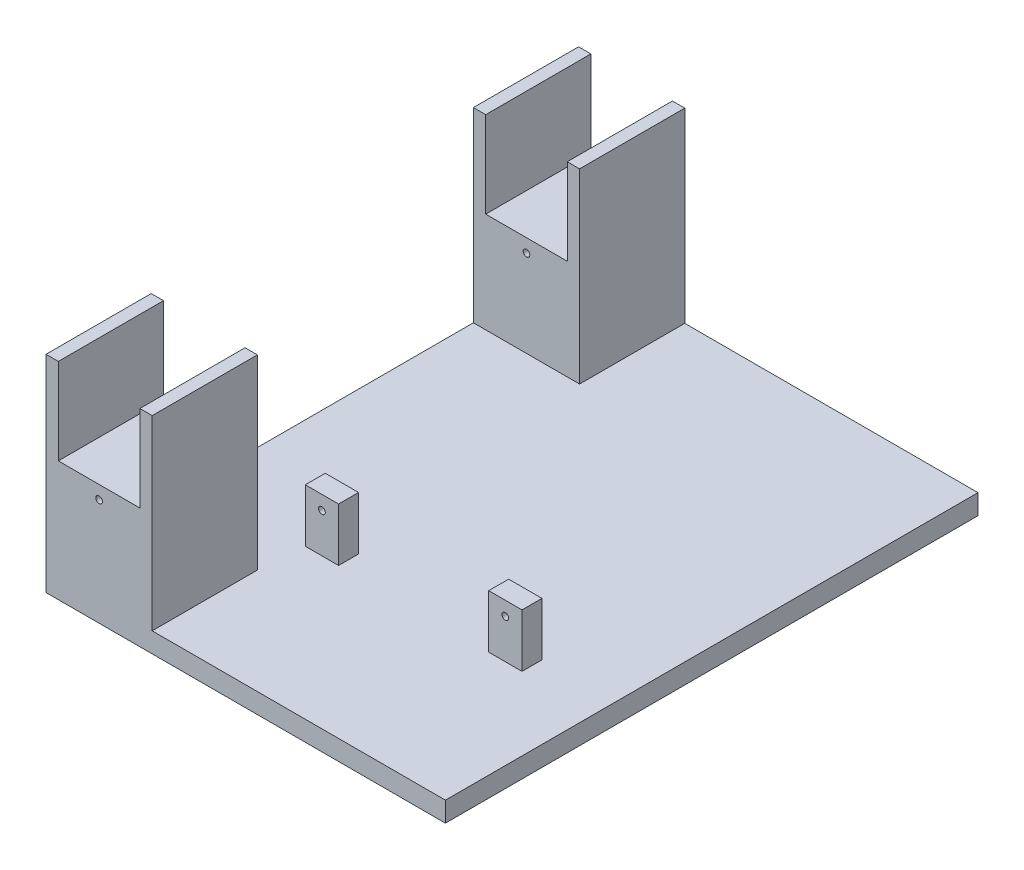
ISO-10303-21;
HEADER;
FILE_DESCRIPTION(('STEP AP214'),'2;1');
FILE_NAME('part.step','',(''),(''),'','','');
FILE_SCHEMA(('AUTOMOTIVE_DESIGN { 1 0 10303 214 1 1 1 1 }'));
ENDSEC;
DATA;
#1=APPLICATION_CONTEXT('core data for automotive mechanical design processes');
#2=APPLICATION_PROTOCOL_DEFINITION('international standard','automotive_design',2000,#1);
#3=PRODUCT_CONTEXT('',#1,'mechanical');
#4=PRODUCT('Part','Part','',(#3));
#5=PRODUCT_RELATED_PRODUCT_CATEGORY('part','',(#4));
#6=PRODUCT_DEFINITION_FORMATION('','',#4);
#7=PRODUCT_DEFINITION_CONTEXT('part definition',#1,'design');
#8=PRODUCT_DEFINITION('design','',#6,#7);
#9=PRODUCT_DEFINITION_SHAPE('','',#8);
#10=(LENGTH_UNIT() NAMED_UNIT(*) SI_UNIT(.MILLI.,.METRE.));
#11=(NAMED_UNIT(*) PLANE_ANGLE_UNIT() SI_UNIT($,.RADIAN.));
#12=(NAMED_UNIT(*) SI_UNIT($,.STERADIAN.) SOLID_ANGLE_UNIT());
#13=UNCERTAINTY_MEASURE_WITH_UNIT(LENGTH_MEASURE(1.E-05),#10,'distance_accuracy_value','');
#14=(GEOMETRIC_REPRESENTATION_CONTEXT(3) GLOBAL_UNCERTAINTY_ASSIGNED_CONTEXT((#13)) GLOBAL_UNIT_ASSIGNED_CONTEXT((#10,
#11,#12)) REPRESENTATION_CONTEXT('',''));
#15=CARTESIAN_POINT('',(0.,0.,0.));
#16=DIRECTION('',(0.,0.,1.));
#17=DIRECTION('',(1.,0.,0.));
#18=AXIS2_PLACEMENT_3D('',#15,#16,#17);
#19=CARTESIAN_POINT('',(0.,3.,0.));
#20=DIRECTION('',(0.,1.,0.));
#21=DIRECTION('',(0.,0.,1.));
#22=AXIS2_PLACEMENT_3D('',#19,#20,#21);
#23=PLANE('',#22);
#24=DIRECTION('',(1.,0.,0.));
#25=VECTOR('',#24,1.);
#26=CARTESIAN_POINT('',(0.,3.,17.5));
#27=LINE('',#26,#25);
#28=CARTESIAN_POINT('',(-13.55,3.,17.5));
#29=VERTEX_POINT('',#28);
#30=CARTESIAN_POINT('',(-8.54999999999999,3.,17.5));
#31=VERTEX_POINT('',#30);
#32=EDGE_CURVE('E290',#29,#31,#27,.T.);
#33=ORIENTED_EDGE('',*,*,#32,.F.);
#34=DIRECTION('',(0.,0.,-1.));
#35=VECTOR('',#34,1.);
#36=CARTESIAN_POINT('',(-13.55,3.,17.5));
#37=LINE('',#36,#35);
#38=CARTESIAN_POINT('',(-13.55,3.,14.5));
#39=VERTEX_POINT('',#38);
#40=EDGE_CURVE('E325',#29,#39,#37,.T.);
#41=ORIENTED_EDGE('',*,*,#40,.T.);
#42=DIRECTION('',(1.,0.,0.));
#43=VECTOR('',#42,1.);
#44=CARTESIAN_POINT('',(0.,3.,14.5));
#45=LINE('',#44,#43);
#46=CARTESIAN_POINT('',(-8.54999999999999,3.,14.5));
#47=VERTEX_POINT('',#46);
#48=EDGE_CURVE('E319',#39,#47,#45,.T.);
#49=ORIENTED_EDGE('',*,*,#48,.T.);
#50=DIRECTION('',(0.,0.,-1.));
#51=VECTOR('',#50,1.);
#52=CARTESIAN_POINT('',(-8.54999999999999,3.,17.5));
#53=LINE('',#52,#51);
#54=EDGE_CURVE('E305',#31,#47,#53,.T.);
#55=ORIENTED_EDGE('',*,*,#54,.F.);
#56=EDGE_LOOP('',(#33,#41,#49,#55));
#57=FACE_BOUND('',#56,.T.);
#58=DIRECTION('',(-1.,0.,0.));
#59=VECTOR('',#58,1.);
#60=CARTESIAN_POINT('',(0.,3.,17.5));
#61=LINE('',#60,#59);
#62=CARTESIAN_POINT('',(19.,3.,17.5));
#63=VERTEX_POINT('',#62);
#64=CARTESIAN_POINT('',(14.,3.,17.5));
#65=VERTEX_POINT('',#64);
#66=EDGE_CURVE('E342',#63,#65,#61,.T.);
#67=ORIENTED_EDGE('',*,*,#66,.T.);
#68=DIRECTION('',(0.,0.,-1.));
#69=VECTOR('',#68,1.);
#70=CARTESIAN_POINT('',(14.,3.,17.5));
#71=LINE('',#70,#69);
#72=CARTESIAN_POINT('',(14.,3.,14.5));
#73=VERTEX_POINT('',#72);
#74=EDGE_CURVE('E371',#65,#73,#71,.T.);
#75=ORIENTED_EDGE('',*,*,#74,.T.);
#76=DIRECTION('',(-1.,0.,0.));
#77=VECTOR('',#76,1.);
#78=CARTESIAN_POINT('',(0.,3.,14.5));
#79=LINE('',#78,#77);
#80=CARTESIAN_POINT('',(19.,3.,14.5));
#81=VERTEX_POINT('',#80);
#82=EDGE_CURVE('E361',#81,#73,#79,.T.);
#83=ORIENTED_EDGE('',*,*,#82,.F.);
#84=DIRECTION('',(0.,0.,-1.));
#85=VECTOR('',#84,1.);
#86=CARTESIAN_POINT('',(19.,3.,17.5));
#87=LINE('',#86,#85);
#88=EDGE_CURVE('E368',#63,#81,#87,.T.);
#89=ORIENTED_EDGE('',*,*,#88,.F.);
#90=EDGE_LOOP('',(#67,#75,#83,#89));
#91=FACE_BOUND('',#90,.T.);
#92=DIRECTION('',(1.,0.,0.));
#93=VECTOR('',#92,1.);
#94=CARTESIAN_POINT('',(-30.,3.,-24.2));
#95=LINE('',#94,#93);
#96=CARTESIAN_POINT('',(-30.,3.,-24.2));
#97=VERTEX_POINT('',#96);
#98=CARTESIAN_POINT('',(-14.05,3.,-24.2));
#99=VERTEX_POINT('',#98);
#100=EDGE_CURVE('E411',#97,#99,#95,.T.);
#101=ORIENTED_EDGE('',*,*,#100,.F.);
#102=DIRECTION('',(0.,0.,1.));
#103=VECTOR('',#102,1.);
#104=CARTESIAN_POINT('',(-30.,3.,-40.));
#105=LINE('',#104,#103);
#106=CARTESIAN_POINT('',(-30.,3.,24.2));
#107=VERTEX_POINT('',#106);
#108=EDGE_CURVE('E547',#97,#107,#105,.T.);
#109=ORIENTED_EDGE('',*,*,#108,.T.);
#110=DIRECTION('',(1.,0.,0.));
#111=VECTOR('',#110,1.);
#112=CARTESIAN_POINT('',(-30.,3.,24.2));
#113=LINE('',#112,#111);
#114=CARTESIAN_POINT('',(-14.05,3.,24.2));
#115=VERTEX_POINT('',#114);
#116=EDGE_CURVE('E494',#107,#115,#113,.T.);
#117=ORIENTED_EDGE('',*,*,#116,.T.);
#118=DIRECTION('',(0.,0.,1.));
#119=VECTOR('',#118,1.);
#120=CARTESIAN_POINT('',(-14.05,3.,24.2));
#121=LINE('',#120,#119);
#122=CARTESIAN_POINT('',(-14.05,3.,40.));
#123=VERTEX_POINT('',#122);
#124=EDGE_CURVE('E525',#115,#123,#121,.T.);
#125=ORIENTED_EDGE('',*,*,#124,.T.);
#126=DIRECTION('',(1.,0.,0.));
#127=VECTOR('',#126,1.);
#128=CARTESIAN_POINT('',(-30.,3.,40.));
#129=LINE('',#128,#127);
#130=CARTESIAN_POINT('',(30.,3.,40.));
#131=VERTEX_POINT('',#130);
#132=EDGE_CURVE('E550',#123,#131,#129,.T.);
#133=ORIENTED_EDGE('',*,*,#132,.T.);
#134=DIRECTION('',(0.,0.,-1.));
#135=VECTOR('',#134,1.);
#136=CARTESIAN_POINT('',(30.,3.,-40.));
#137=LINE('',#136,#135);
#138=CARTESIAN_POINT('',(30.,3.,-40.));
#139=VERTEX_POINT('',#138);
#140=EDGE_CURVE('E554',#131,#139,#137,.T.);
#141=ORIENTED_EDGE('',*,*,#140,.T.);
#142=DIRECTION('',(-1.,0.,0.));
#143=VECTOR('',#142,1.);
#144=CARTESIAN_POINT('',(-30.,3.,-40.));
#145=LINE('',#144,#143);
#146=CARTESIAN_POINT('',(-14.05,3.,-40.));
#147=VERTEX_POINT('',#146);
#148=EDGE_CURVE('E557',#139,#147,#145,.T.);
#149=ORIENTED_EDGE('',*,*,#148,.T.);
#150=DIRECTION('',(0.,0.,-1.));
#151=VECTOR('',#150,1.);
#152=CARTESIAN_POINT('',(-14.05,3.,-24.2));
#153=LINE('',#152,#151);
#154=EDGE_CURVE('E447',#99,#147,#153,.T.);
#155=ORIENTED_EDGE('',*,*,#154,.F.);
#156=EDGE_LOOP('',(#101,#109,#117,#125,#133,#141,#149,#155));
#157=FACE_BOUND('',#156,.T.);
#158=ADVANCED_FACE('F97',(#57,#91,#157),#23,.T.);
#159=CARTESIAN_POINT('',(-30.,3.,-40.));
#160=DIRECTION('',(1.,0.,0.));
#161=DIRECTION('',(0.,0.,-1.));
#162=AXIS2_PLACEMENT_3D('',#159,#160,#161);
#163=PLANE('',#162);
#164=DIRECTION('',(0.,0.,1.));
#165=VECTOR('',#164,1.);
#166=CARTESIAN_POINT('',(-30.,0.,-40.));
#167=LINE('',#166,#165);
#168=CARTESIAN_POINT('',(-30.,0.,-40.));
#169=VERTEX_POINT('',#168);
#170=CARTESIAN_POINT('',(-30.,0.,40.));
#171=VERTEX_POINT('',#170);
#172=EDGE_CURVE('E546',#169,#171,#167,.T.);
#173=ORIENTED_EDGE('',*,*,#172,.T.);
#174=DIRECTION('',(0.,-1.,0.));
#175=VECTOR('',#174,1.);
#176=CARTESIAN_POINT('',(-30.,3.,40.));
#177=LINE('',#176,#175);
#178=CARTESIAN_POINT('',(-30.,31.,40.));
#179=VERTEX_POINT('',#178);
#180=EDGE_CURVE('E12',#179,#171,#177,.T.);
#181=ORIENTED_EDGE('',*,*,#180,.F.);
#182=DIRECTION('',(0.,0.,1.));
#183=VECTOR('',#182,1.);
#184=CARTESIAN_POINT('',(-30.,31.,24.2));
#185=LINE('',#184,#183);
#186=CARTESIAN_POINT('',(-30.,31.,24.2));
#187=VERTEX_POINT('',#186);
#188=EDGE_CURVE('E501',#187,#179,#185,.T.);
#189=ORIENTED_EDGE('',*,*,#188,.F.);
#190=DIRECTION('',(0.,1.,0.));
#191=VECTOR('',#190,1.);
#192=CARTESIAN_POINT('',(-30.,3.,24.2));
#193=LINE('',#192,#191);
#194=EDGE_CURVE('E498',#107,#187,#193,.T.);
#195=ORIENTED_EDGE('',*,*,#194,.F.);
#196=ORIENTED_EDGE('',*,*,#108,.F.);
#197=DIRECTION('',(0.,1.,0.));
#198=VECTOR('',#197,1.);
#199=CARTESIAN_POINT('',(-30.,3.,-24.2));
#200=LINE('',#199,#198);
#201=CARTESIAN_POINT('',(-30.,31.,-24.2));
#202=VERTEX_POINT('',#201);
#203=EDGE_CURVE('E415',#97,#202,#200,.T.);
#204=ORIENTED_EDGE('',*,*,#203,.T.);
#205=DIRECTION('',(0.,0.,-1.));
#206=VECTOR('',#205,1.);
#207=CARTESIAN_POINT('',(-30.,31.,-24.2));
#208=LINE('',#207,#206);
#209=CARTESIAN_POINT('',(-30.,31.,-40.));
#210=VERTEX_POINT('',#209);
#211=EDGE_CURVE('E442',#202,#210,#208,.T.);
#212=ORIENTED_EDGE('',*,*,#211,.T.);
#213=DIRECTION('',(0.,-1.,0.));
#214=VECTOR('',#213,1.);
#215=CARTESIAN_POINT('',(-30.,3.,-40.));
#216=LINE('',#215,#214);
#217=EDGE_CURVE('E560',#210,#169,#216,.T.);
#218=ORIENTED_EDGE('',*,*,#217,.T.);
#219=EDGE_LOOP('',(#173,#181,#189,#195,#196,#204,#212,#218));
#220=FACE_BOUND('',#219,.T.);
#221=ADVANCED_FACE('F99',(#220),#163,.F.);
#222=CARTESIAN_POINT('',(-30.,3.,40.));
#223=DIRECTION('',(0.,0.,-1.));
#224=DIRECTION('',(-1.,0.,0.));
#225=AXIS2_PLACEMENT_3D('',#222,#223,#224);
#226=PLANE('',#225);
#227=DIRECTION('',(1.,0.,0.));
#228=VECTOR('',#227,1.);
#229=CARTESIAN_POINT('',(-30.,0.,40.));
#230=LINE('',#229,#228);
#231=CARTESIAN_POINT('',(30.,0.,40.));
#232=VERTEX_POINT('',#231);
#233=EDGE_CURVE('E564',#171,#232,#230,.T.);
#234=ORIENTED_EDGE('',*,*,#233,.T.);
#235=DIRECTION('',(0.,-1.,0.));
#236=VECTOR('',#235,1.);
#237=CARTESIAN_POINT('',(30.,3.,40.));
#238=LINE('',#237,#236);
#239=EDGE_CURVE('E106',#131,#232,#238,.T.);
#240=ORIENTED_EDGE('',*,*,#239,.F.);
#241=ORIENTED_EDGE('',*,*,#132,.F.);
#242=DIRECTION('',(0.,1.,0.));
#243=VECTOR('',#242,1.);
#244=CARTESIAN_POINT('',(-14.05,3.,40.));
#245=LINE('',#244,#243);
#246=CARTESIAN_POINT('',(-14.05,31.,40.));
#247=VERTEX_POINT('',#246);
#248=EDGE_CURVE('E477',#123,#247,#245,.T.);
#249=ORIENTED_EDGE('',*,*,#248,.T.);
#250=DIRECTION('',(1.,0.,0.));
#251=VECTOR('',#250,1.);
#252=CARTESIAN_POINT('',(-30.,31.,40.));
#253=LINE('',#252,#251);
#254=CARTESIAN_POINT('',(-15.9,31.,40.));
#255=VERTEX_POINT('',#254);
#256=EDGE_CURVE('E515',#255,#247,#253,.T.);
#257=ORIENTED_EDGE('',*,*,#256,.F.);
#258=DIRECTION('',(0.,1.,0.));
#259=VECTOR('',#258,1.);
#260=CARTESIAN_POINT('',(-15.9,3.,40.));
#261=LINE('',#260,#259);
#262=CARTESIAN_POINT('',(-15.9,18.0561761961018,40.));
#263=VERTEX_POINT('',#262);
#264=EDGE_CURVE('E512',#263,#255,#261,.T.);
#265=ORIENTED_EDGE('',*,*,#264,.F.);
#266=DIRECTION('',(1.,0.,0.));
#267=VECTOR('',#266,1.);
#268=CARTESIAN_POINT('',(-30.,18.0561761961018,40.));
#269=LINE('',#268,#267);
#270=CARTESIAN_POINT('',(-28.15,18.0561761961018,40.));
#271=VERTEX_POINT('',#270);
#272=EDGE_CURVE('E509',#271,#263,#269,.T.);
#273=ORIENTED_EDGE('',*,*,#272,.F.);
#274=DIRECTION('',(0.,1.,0.));
#275=VECTOR('',#274,1.);
#276=CARTESIAN_POINT('',(-28.15,3.,40.));
#277=LINE('',#276,#275);
#278=CARTESIAN_POINT('',(-28.15,31.,40.));
#279=VERTEX_POINT('',#278);
#280=EDGE_CURVE('E505',#271,#279,#277,.T.);
#281=ORIENTED_EDGE('',*,*,#280,.T.);
#282=DIRECTION('',(1.,0.,0.));
#283=VECTOR('',#282,1.);
#284=CARTESIAN_POINT('',(-30.,31.,40.));
#285=LINE('',#284,#283);
#286=EDGE_CURVE('E469',#179,#279,#285,.T.);
#287=ORIENTED_EDGE('',*,*,#286,.F.);
#288=ORIENTED_EDGE('',*,*,#180,.T.);
#289=EDGE_LOOP('',(#234,#240,#241,#249,#257,#265,#273,#281,#287,#288));
#290=FACE_BOUND('',#289,.T.);
#291=CARTESIAN_POINT('',(-22.025,16.0561761961018,40.));
#292=DIRECTION('',(0.,0.,-1.));
#293=DIRECTION('',(-1.,0.,0.));
#294=AXIS2_PLACEMENT_3D('',#291,#292,#293);
#295=CIRCLE('',#294,0.499999999999999);
#296=CARTESIAN_POINT('',(-22.525,16.0561761961018,40.));
#297=VERTEX_POINT('',#296);
#298=EDGE_CURVE('E446',#297,#297,#295,.T.);
#299=ORIENTED_EDGE('',*,*,#298,.T.);
#300=EDGE_LOOP('',(#299));
#301=FACE_BOUND('',#300,.T.);
#302=ADVANCED_FACE('F647',(#290,#301),#226,.F.);
#303=CARTESIAN_POINT('',(30.,3.,-40.));
#304=DIRECTION('',(-1.,0.,0.));
#305=DIRECTION('',(0.,0.,1.));
#306=AXIS2_PLACEMENT_3D('',#303,#304,#305);
#307=PLANE('',#306);
#308=DIRECTION('',(0.,0.,-1.));
#309=VECTOR('',#308,1.);
#310=CARTESIAN_POINT('',(30.,0.,-40.));
#311=LINE('',#310,#309);
#312=CARTESIAN_POINT('',(30.,0.,-40.));
#313=VERTEX_POINT('',#312);
#314=EDGE_CURVE('E567',#232,#313,#311,.T.);
#315=ORIENTED_EDGE('',*,*,#314,.T.);
#316=DIRECTION('',(0.,-1.,0.));
#317=VECTOR('',#316,1.);
#318=CARTESIAN_POINT('',(30.,3.,-40.));
#319=LINE('',#318,#317);
#320=EDGE_CURVE('E575',#139,#313,#319,.T.);
#321=ORIENTED_EDGE('',*,*,#320,.F.);
#322=ORIENTED_EDGE('',*,*,#140,.F.);
#323=ORIENTED_EDGE('',*,*,#239,.T.);
#324=EDGE_LOOP('',(#315,#321,#322,#323));
#325=FACE_BOUND('',#324,.T.);
#326=ADVANCED_FACE('F584',(#325),#307,.F.);
#327=CARTESIAN_POINT('',(-30.,3.,-40.));
#328=DIRECTION('',(0.,0.,1.));
#329=DIRECTION('',(1.,0.,0.));
#330=AXIS2_PLACEMENT_3D('',#327,#328,#329);
#331=PLANE('',#330);
#332=DIRECTION('',(-1.,0.,0.));
#333=VECTOR('',#332,1.);
#334=CARTESIAN_POINT('',(-30.,0.,-40.));
#335=LINE('',#334,#333);
#336=EDGE_CURVE('E551',#313,#169,#335,.T.);
#337=ORIENTED_EDGE('',*,*,#336,.T.);
#338=ORIENTED_EDGE('',*,*,#217,.F.);
#339=DIRECTION('',(1.,0.,0.));
#340=VECTOR('',#339,1.);
#341=CARTESIAN_POINT('',(-30.,31.,-40.));
#342=LINE('',#341,#340);
#343=CARTESIAN_POINT('',(-28.15,31.,-40.));
#344=VERTEX_POINT('',#343);
#345=EDGE_CURVE('E384',#210,#344,#342,.T.);
#346=ORIENTED_EDGE('',*,*,#345,.T.);
#347=DIRECTION('',(0.,1.,0.));
#348=VECTOR('',#347,1.);
#349=CARTESIAN_POINT('',(-28.15,3.,-40.));
#350=LINE('',#349,#348);
#351=CARTESIAN_POINT('',(-28.15,18.0561761961018,-40.));
#352=VERTEX_POINT('',#351);
#353=EDGE_CURVE('E423',#352,#344,#350,.T.);
#354=ORIENTED_EDGE('',*,*,#353,.F.);
#355=DIRECTION('',(1.,0.,0.));
#356=VECTOR('',#355,1.);
#357=CARTESIAN_POINT('',(-30.,18.0561761961018,-40.));
#358=LINE('',#357,#356);
#359=CARTESIAN_POINT('',(-15.9,18.0561761961018,-40.));
#360=VERTEX_POINT('',#359);
#361=EDGE_CURVE('E427',#352,#360,#358,.T.);
#362=ORIENTED_EDGE('',*,*,#361,.T.);
#363=DIRECTION('',(0.,1.,0.));
#364=VECTOR('',#363,1.);
#365=CARTESIAN_POINT('',(-15.9,3.,-40.));
#366=LINE('',#365,#364);
#367=CARTESIAN_POINT('',(-15.9,31.,-40.));
#368=VERTEX_POINT('',#367);
#369=EDGE_CURVE('E431',#360,#368,#366,.T.);
#370=ORIENTED_EDGE('',*,*,#369,.T.);
#371=DIRECTION('',(1.,0.,0.));
#372=VECTOR('',#371,1.);
#373=CARTESIAN_POINT('',(-30.,31.,-40.));
#374=LINE('',#373,#372);
#375=CARTESIAN_POINT('',(-14.05,31.,-40.));
#376=VERTEX_POINT('',#375);
#377=EDGE_CURVE('E435',#368,#376,#374,.T.);
#378=ORIENTED_EDGE('',*,*,#377,.T.);
#379=DIRECTION('',(0.,1.,0.));
#380=VECTOR('',#379,1.);
#381=CARTESIAN_POINT('',(-14.05,3.,-40.));
#382=LINE('',#381,#380);
#383=EDGE_CURVE('E393',#147,#376,#382,.T.);
#384=ORIENTED_EDGE('',*,*,#383,.F.);
#385=ORIENTED_EDGE('',*,*,#148,.F.);
#386=ORIENTED_EDGE('',*,*,#320,.T.);
#387=EDGE_LOOP('',(#337,#338,#346,#354,#362,#370,#378,#384,#385,#386));
#388=FACE_BOUND('',#387,.T.);
#389=CARTESIAN_POINT('',(-22.025,16.0561761961018,-40.));
#390=DIRECTION('',(0.,0.,1.));
#391=DIRECTION('',(1.,0.,0.));
#392=AXIS2_PLACEMENT_3D('',#389,#390,#391);
#393=CIRCLE('',#392,0.499999999999999);
#394=CARTESIAN_POINT('',(-21.525,16.0561761961018,-40.));
#395=VERTEX_POINT('',#394);
#396=EDGE_CURVE('E379',#395,#395,#393,.T.);
#397=ORIENTED_EDGE('',*,*,#396,.T.);
#398=EDGE_LOOP('',(#397));
#399=FACE_BOUND('',#398,.T.);
#400=ADVANCED_FACE('F593',(#388,#399),#331,.F.);
#401=CARTESIAN_POINT('',(0.,0.,0.));
#402=DIRECTION('',(0.,1.,0.));
#403=DIRECTION('',(0.,0.,1.));
#404=AXIS2_PLACEMENT_3D('',#401,#402,#403);
#405=PLANE('',#404);
#406=ORIENTED_EDGE('',*,*,#172,.F.);
#407=ORIENTED_EDGE('',*,*,#336,.F.);
#408=ORIENTED_EDGE('',*,*,#314,.F.);
#409=ORIENTED_EDGE('',*,*,#233,.F.);
#410=EDGE_LOOP('',(#406,#407,#408,#409));
#411=FACE_BOUND('',#410,.T.);
#412=ADVANCED_FACE('F591',(#411),#405,.F.);
#413=CARTESIAN_POINT('',(0.,0.,24.2));
#414=DIRECTION('',(0.,0.,1.));
#415=DIRECTION('',(1.,0.,0.));
#416=AXIS2_PLACEMENT_3D('',#413,#414,#415);
#417=PLANE('',#416);
#418=DIRECTION('',(1.,0.,0.));
#419=VECTOR('',#418,1.);
#420=CARTESIAN_POINT('',(-30.,31.,24.2));
#421=LINE('',#420,#419);
#422=CARTESIAN_POINT('',(-28.15,31.,24.2));
#423=VERTEX_POINT('',#422);
#424=EDGE_CURVE('E473',#187,#423,#421,.T.);
#425=ORIENTED_EDGE('',*,*,#424,.T.);
#426=DIRECTION('',(0.,1.,0.));
#427=VECTOR('',#426,1.);
#428=CARTESIAN_POINT('',(-28.15,3.,24.2));
#429=LINE('',#428,#427);
#430=CARTESIAN_POINT('',(-28.15,18.0561761961018,24.2));
#431=VERTEX_POINT('',#430);
#432=EDGE_CURVE('E476',#431,#423,#429,.T.);
#433=ORIENTED_EDGE('',*,*,#432,.F.);
#434=DIRECTION('',(1.,0.,0.));
#435=VECTOR('',#434,1.);
#436=CARTESIAN_POINT('',(-30.,18.0561761961018,24.2));
#437=LINE('',#436,#435);
#438=CARTESIAN_POINT('',(-15.9,18.0561761961018,24.2));
#439=VERTEX_POINT('',#438);
#440=EDGE_CURVE('E481',#431,#439,#437,.T.);
#441=ORIENTED_EDGE('',*,*,#440,.T.);
#442=DIRECTION('',(0.,1.,0.));
#443=VECTOR('',#442,1.);
#444=CARTESIAN_POINT('',(-15.9,3.,24.2));
#445=LINE('',#444,#443);
#446=CARTESIAN_POINT('',(-15.9,31.,24.2));
#447=VERTEX_POINT('',#446);
#448=EDGE_CURVE('E484',#439,#447,#445,.T.);
#449=ORIENTED_EDGE('',*,*,#448,.T.);
#450=DIRECTION('',(1.,0.,0.));
#451=VECTOR('',#450,1.);
#452=CARTESIAN_POINT('',(-30.,31.,24.2));
#453=LINE('',#452,#451);
#454=CARTESIAN_POINT('',(-14.05,31.,24.2));
#455=VERTEX_POINT('',#454);
#456=EDGE_CURVE('E487',#447,#455,#453,.T.);
#457=ORIENTED_EDGE('',*,*,#456,.T.);
#458=DIRECTION('',(0.,1.,0.));
#459=VECTOR('',#458,1.);
#460=CARTESIAN_POINT('',(-14.05,3.,24.2));
#461=LINE('',#460,#459);
#462=EDGE_CURVE('E490',#115,#455,#461,.T.);
#463=ORIENTED_EDGE('',*,*,#462,.F.);
#464=ORIENTED_EDGE('',*,*,#116,.F.);
#465=ORIENTED_EDGE('',*,*,#194,.T.);
#466=EDGE_LOOP('',(#425,#433,#441,#449,#457,#463,#464,#465));
#467=FACE_BOUND('',#466,.T.);
#468=CARTESIAN_POINT('',(-22.025,16.0561761961018,24.2));
#469=DIRECTION('',(0.,0.,-1.));
#470=DIRECTION('',(-1.,0.,0.));
#471=AXIS2_PLACEMENT_3D('',#468,#469,#470);
#472=CIRCLE('',#471,0.499999999999999);
#473=CARTESIAN_POINT('',(-22.525,16.0561761961018,24.2));
#474=VERTEX_POINT('',#473);
#475=EDGE_CURVE('E465',#474,#474,#472,.T.);
#476=ORIENTED_EDGE('',*,*,#475,.F.);
#477=EDGE_LOOP('',(#476));
#478=FACE_BOUND('',#477,.T.);
#479=ADVANCED_FACE('F655',(#467,#478),#417,.F.);
#480=CARTESIAN_POINT('',(-30.,31.,24.2));
#481=DIRECTION('',(0.,-1.,0.));
#482=DIRECTION('',(0.,0.,-1.));
#483=AXIS2_PLACEMENT_3D('',#480,#481,#482);
#484=PLANE('',#483);
#485=ORIENTED_EDGE('',*,*,#286,.T.);
#486=DIRECTION('',(0.,0.,1.));
#487=VECTOR('',#486,1.);
#488=CARTESIAN_POINT('',(-28.15,31.,24.2));
#489=LINE('',#488,#487);
#490=EDGE_CURVE('E543',#423,#279,#489,.T.);
#491=ORIENTED_EDGE('',*,*,#490,.F.);
#492=ORIENTED_EDGE('',*,*,#424,.F.);
#493=ORIENTED_EDGE('',*,*,#188,.T.);
#494=EDGE_LOOP('',(#485,#491,#492,#493));
#495=FACE_BOUND('',#494,.T.);
#496=ADVANCED_FACE('F651',(#495),#484,.F.);
#497=CARTESIAN_POINT('',(-28.15,3.,24.2));
#498=DIRECTION('',(1.,0.,0.));
#499=DIRECTION('',(0.,0.,-1.));
#500=AXIS2_PLACEMENT_3D('',#497,#498,#499);
#501=PLANE('',#500);
#502=ORIENTED_EDGE('',*,*,#280,.F.);
#503=DIRECTION('',(0.,0.,1.));
#504=VECTOR('',#503,1.);
#505=CARTESIAN_POINT('',(-28.15,18.0561761961018,24.2));
#506=LINE('',#505,#504);
#507=EDGE_CURVE('E540',#431,#271,#506,.T.);
#508=ORIENTED_EDGE('',*,*,#507,.F.);
#509=ORIENTED_EDGE('',*,*,#432,.T.);
#510=ORIENTED_EDGE('',*,*,#490,.T.);
#511=EDGE_LOOP('',(#502,#508,#509,#510));
#512=FACE_BOUND('',#511,.T.);
#513=ADVANCED_FACE('F691',(#512),#501,.T.);
#514=CARTESIAN_POINT('',(-30.,18.0561761961018,24.2));
#515=DIRECTION('',(0.,-1.,0.));
#516=DIRECTION('',(0.,0.,-1.));
#517=AXIS2_PLACEMENT_3D('',#514,#515,#516);
#518=PLANE('',#517);
#519=ORIENTED_EDGE('',*,*,#272,.T.);
#520=DIRECTION('',(0.,0.,1.));
#521=VECTOR('',#520,1.);
#522=CARTESIAN_POINT('',(-15.9,18.0561761961018,24.2));
#523=LINE('',#522,#521);
#524=EDGE_CURVE('E536',#439,#263,#523,.T.);
#525=ORIENTED_EDGE('',*,*,#524,.F.);
#526=ORIENTED_EDGE('',*,*,#440,.F.);
#527=ORIENTED_EDGE('',*,*,#507,.T.);
#528=EDGE_LOOP('',(#519,#525,#526,#527));
#529=FACE_BOUND('',#528,.T.);
#530=ADVANCED_FACE('F688',(#529),#518,.F.);
#531=CARTESIAN_POINT('',(-15.9,3.,24.2));
#532=DIRECTION('',(1.,0.,0.));
#533=DIRECTION('',(0.,0.,-1.));
#534=AXIS2_PLACEMENT_3D('',#531,#532,#533);
#535=PLANE('',#534);
#536=ORIENTED_EDGE('',*,*,#264,.T.);
#537=DIRECTION('',(0.,0.,1.));
#538=VECTOR('',#537,1.);
#539=CARTESIAN_POINT('',(-15.9,31.,24.2));
#540=LINE('',#539,#538);
#541=EDGE_CURVE('E532',#447,#255,#540,.T.);
#542=ORIENTED_EDGE('',*,*,#541,.F.);
#543=ORIENTED_EDGE('',*,*,#448,.F.);
#544=ORIENTED_EDGE('',*,*,#524,.T.);
#545=EDGE_LOOP('',(#536,#542,#543,#544));
#546=FACE_BOUND('',#545,.T.);
#547=ADVANCED_FACE('F684',(#546),#535,.F.);
#548=CARTESIAN_POINT('',(-30.,31.,24.2));
#549=DIRECTION('',(0.,-1.,0.));
#550=DIRECTION('',(0.,0.,-1.));
#551=AXIS2_PLACEMENT_3D('',#548,#549,#550);
#552=PLANE('',#551);
#553=ORIENTED_EDGE('',*,*,#256,.T.);
#554=DIRECTION('',(0.,0.,1.));
#555=VECTOR('',#554,1.);
#556=CARTESIAN_POINT('',(-14.05,31.,24.2));
#557=LINE('',#556,#555);
#558=EDGE_CURVE('E529',#455,#247,#557,.T.);
#559=ORIENTED_EDGE('',*,*,#558,.F.);
#560=ORIENTED_EDGE('',*,*,#456,.F.);
#561=ORIENTED_EDGE('',*,*,#541,.T.);
#562=EDGE_LOOP('',(#553,#559,#560,#561));
#563=FACE_BOUND('',#562,.T.);
#564=ADVANCED_FACE('F675',(#563),#552,.F.);
#565=CARTESIAN_POINT('',(-14.05,3.,24.2));
#566=DIRECTION('',(1.,0.,0.));
#567=DIRECTION('',(0.,1.,0.));
#568=AXIS2_PLACEMENT_3D('',#565,#566,#567);
#569=PLANE('',#568);
#570=ORIENTED_EDGE('',*,*,#248,.F.);
#571=ORIENTED_EDGE('',*,*,#124,.F.);
#572=ORIENTED_EDGE('',*,*,#462,.T.);
#573=ORIENTED_EDGE('',*,*,#558,.T.);
#574=EDGE_LOOP('',(#570,#571,#572,#573));
#575=FACE_BOUND('',#574,.T.);
#576=ADVANCED_FACE('F667',(#575),#569,.T.);
#577=CARTESIAN_POINT('',(-22.025,16.0561761961018,24.2));
#578=DIRECTION('',(0.,0.,1.));
#579=DIRECTION('',(1.,0.,0.));
#580=AXIS2_PLACEMENT_3D('',#577,#578,#579);
#581=CYLINDRICAL_SURFACE('',#580,0.499999999999999);
#582=ORIENTED_EDGE('',*,*,#475,.T.);
#583=EDGE_LOOP('',(#582));
#584=FACE_BOUND('',#583,.T.);
#585=ORIENTED_EDGE('',*,*,#298,.F.);
#586=EDGE_LOOP('',(#585));
#587=FACE_BOUND('',#586,.T.);
#588=ADVANCED_FACE('F665',(#584,#587),#581,.F.);
#589=CARTESIAN_POINT('',(0.,0.,-24.2));
#590=DIRECTION('',(0.,0.,1.));
#591=DIRECTION('',(1.,0.,0.));
#592=AXIS2_PLACEMENT_3D('',#589,#590,#591);
#593=PLANE('',#592);
#594=DIRECTION('',(1.,0.,0.));
#595=VECTOR('',#594,1.);
#596=CARTESIAN_POINT('',(-30.,31.,-24.2));
#597=LINE('',#596,#595);
#598=CARTESIAN_POINT('',(-28.15,31.,-24.2));
#599=VERTEX_POINT('',#598);
#600=EDGE_CURVE('E388',#202,#599,#597,.T.);
#601=ORIENTED_EDGE('',*,*,#600,.F.);
#602=ORIENTED_EDGE('',*,*,#203,.F.);
#603=ORIENTED_EDGE('',*,*,#100,.T.);
#604=DIRECTION('',(0.,1.,0.));
#605=VECTOR('',#604,1.);
#606=CARTESIAN_POINT('',(-14.05,3.,-24.2));
#607=LINE('',#606,#605);
#608=CARTESIAN_POINT('',(-14.05,31.,-24.2));
#609=VERTEX_POINT('',#608);
#610=EDGE_CURVE('E408',#99,#609,#607,.T.);
#611=ORIENTED_EDGE('',*,*,#610,.T.);
#612=DIRECTION('',(1.,0.,0.));
#613=VECTOR('',#612,1.);
#614=CARTESIAN_POINT('',(-30.,31.,-24.2));
#615=LINE('',#614,#613);
#616=CARTESIAN_POINT('',(-15.9,31.,-24.2));
#617=VERTEX_POINT('',#616);
#618=EDGE_CURVE('E404',#617,#609,#615,.T.);
#619=ORIENTED_EDGE('',*,*,#618,.F.);
#620=DIRECTION('',(0.,1.,0.));
#621=VECTOR('',#620,1.);
#622=CARTESIAN_POINT('',(-15.9,3.,-24.2));
#623=LINE('',#622,#621);
#624=CARTESIAN_POINT('',(-15.9,18.0561761961018,-24.2));
#625=VERTEX_POINT('',#624);
#626=EDGE_CURVE('E400',#625,#617,#623,.T.);
#627=ORIENTED_EDGE('',*,*,#626,.F.);
#628=DIRECTION('',(1.,0.,0.));
#629=VECTOR('',#628,1.);
#630=CARTESIAN_POINT('',(-30.,18.0561761961018,-24.2));
#631=LINE('',#630,#629);
#632=CARTESIAN_POINT('',(-28.15,18.0561761961018,-24.2));
#633=VERTEX_POINT('',#632);
#634=EDGE_CURVE('E396',#633,#625,#631,.T.);
#635=ORIENTED_EDGE('',*,*,#634,.F.);
#636=DIRECTION('',(0.,1.,0.));
#637=VECTOR('',#636,1.);
#638=CARTESIAN_POINT('',(-28.15,3.,-24.2));
#639=LINE('',#638,#637);
#640=EDGE_CURVE('E392',#633,#599,#639,.T.);
#641=ORIENTED_EDGE('',*,*,#640,.T.);
#642=EDGE_LOOP('',(#601,#602,#603,#611,#619,#627,#635,#641));
#643=FACE_BOUND('',#642,.T.);
#644=CARTESIAN_POINT('',(-22.025,16.0561761961018,-24.2));
#645=DIRECTION('',(0.,0.,1.));
#646=DIRECTION('',(1.,0.,0.));
#647=AXIS2_PLACEMENT_3D('',#644,#645,#646);
#648=CIRCLE('',#647,0.499999999999999);
#649=CARTESIAN_POINT('',(-21.525,16.0561761961018,-24.2));
#650=VERTEX_POINT('',#649);
#651=EDGE_CURVE('E380',#650,#650,#648,.T.);
#652=ORIENTED_EDGE('',*,*,#651,.F.);
#653=EDGE_LOOP('',(#652));
#654=FACE_BOUND('',#653,.T.);
#655=ADVANCED_FACE('F626',(#643,#654),#593,.T.);
#656=CARTESIAN_POINT('',(-30.,31.,-24.2));
#657=DIRECTION('',(0.,1.,0.));
#658=DIRECTION('',(0.,0.,1.));
#659=AXIS2_PLACEMENT_3D('',#656,#657,#658);
#660=PLANE('',#659);
#661=ORIENTED_EDGE('',*,*,#345,.F.);
#662=ORIENTED_EDGE('',*,*,#211,.F.);
#663=ORIENTED_EDGE('',*,*,#600,.T.);
#664=DIRECTION('',(0.,0.,-1.));
#665=VECTOR('',#664,1.);
#666=CARTESIAN_POINT('',(-28.15,31.,-24.2));
#667=LINE('',#666,#665);
#668=EDGE_CURVE('E419',#599,#344,#667,.T.);
#669=ORIENTED_EDGE('',*,*,#668,.T.);
#670=EDGE_LOOP('',(#661,#662,#663,#669));
#671=FACE_BOUND('',#670,.T.);
#672=ADVANCED_FACE('F602',(#671),#660,.T.);
#673=CARTESIAN_POINT('',(-14.05,3.,-24.2));
#674=DIRECTION('',(-1.,0.,0.));
#675=DIRECTION('',(0.,-1.,0.));
#676=AXIS2_PLACEMENT_3D('',#673,#674,#675);
#677=PLANE('',#676);
#678=ORIENTED_EDGE('',*,*,#383,.T.);
#679=DIRECTION('',(0.,0.,-1.));
#680=VECTOR('',#679,1.);
#681=CARTESIAN_POINT('',(-14.05,31.,-24.2));
#682=LINE('',#681,#680);
#683=EDGE_CURVE('E451',#609,#376,#682,.T.);
#684=ORIENTED_EDGE('',*,*,#683,.F.);
#685=ORIENTED_EDGE('',*,*,#610,.F.);
#686=ORIENTED_EDGE('',*,*,#154,.T.);
#687=EDGE_LOOP('',(#678,#684,#685,#686));
#688=FACE_BOUND('',#687,.T.);
#689=ADVANCED_FACE('F623',(#688),#677,.F.);
#690=CARTESIAN_POINT('',(-30.,31.,-24.2));
#691=DIRECTION('',(0.,1.,0.));
#692=DIRECTION('',(0.,0.,1.));
#693=AXIS2_PLACEMENT_3D('',#690,#691,#692);
#694=PLANE('',#693);
#695=ORIENTED_EDGE('',*,*,#377,.F.);
#696=DIRECTION('',(0.,0.,-1.));
#697=VECTOR('',#696,1.);
#698=CARTESIAN_POINT('',(-15.9,31.,-24.2));
#699=LINE('',#698,#697);
#700=EDGE_CURVE('E454',#617,#368,#699,.T.);
#701=ORIENTED_EDGE('',*,*,#700,.F.);
#702=ORIENTED_EDGE('',*,*,#618,.T.);
#703=ORIENTED_EDGE('',*,*,#683,.T.);
#704=EDGE_LOOP('',(#695,#701,#702,#703));
#705=FACE_BOUND('',#704,.T.);
#706=ADVANCED_FACE('F618',(#705),#694,.T.);
#707=CARTESIAN_POINT('',(-15.9,3.,-24.2));
#708=DIRECTION('',(-1.,0.,0.));
#709=DIRECTION('',(0.,0.,1.));
#710=AXIS2_PLACEMENT_3D('',#707,#708,#709);
#711=PLANE('',#710);
#712=ORIENTED_EDGE('',*,*,#369,.F.);
#713=DIRECTION('',(0.,0.,-1.));
#714=VECTOR('',#713,1.);
#715=CARTESIAN_POINT('',(-15.9,18.0561761961018,-24.2));
#716=LINE('',#715,#714);
#717=EDGE_CURVE('E457',#625,#360,#716,.T.);
#718=ORIENTED_EDGE('',*,*,#717,.F.);
#719=ORIENTED_EDGE('',*,*,#626,.T.);
#720=ORIENTED_EDGE('',*,*,#700,.T.);
#721=EDGE_LOOP('',(#712,#718,#719,#720));
#722=FACE_BOUND('',#721,.T.);
#723=ADVANCED_FACE('F614',(#722),#711,.T.);
#724=CARTESIAN_POINT('',(-30.,18.0561761961018,-24.2));
#725=DIRECTION('',(0.,1.,0.));
#726=DIRECTION('',(0.,0.,1.));
#727=AXIS2_PLACEMENT_3D('',#724,#725,#726);
#728=PLANE('',#727);
#729=ORIENTED_EDGE('',*,*,#361,.F.);
#730=DIRECTION('',(0.,0.,-1.));
#731=VECTOR('',#730,1.);
#732=CARTESIAN_POINT('',(-28.15,18.0561761961018,-24.2));
#733=LINE('',#732,#731);
#734=EDGE_CURVE('E460',#633,#352,#733,.T.);
#735=ORIENTED_EDGE('',*,*,#734,.F.);
#736=ORIENTED_EDGE('',*,*,#634,.T.);
#737=ORIENTED_EDGE('',*,*,#717,.T.);
#738=EDGE_LOOP('',(#729,#735,#736,#737));
#739=FACE_BOUND('',#738,.T.);
#740=ADVANCED_FACE('F608',(#739),#728,.T.);
#741=CARTESIAN_POINT('',(-28.15,3.,-24.2));
#742=DIRECTION('',(-1.,0.,0.));
#743=DIRECTION('',(0.,0.,1.));
#744=AXIS2_PLACEMENT_3D('',#741,#742,#743);
#745=PLANE('',#744);
#746=ORIENTED_EDGE('',*,*,#353,.T.);
#747=ORIENTED_EDGE('',*,*,#668,.F.);
#748=ORIENTED_EDGE('',*,*,#640,.F.);
#749=ORIENTED_EDGE('',*,*,#734,.T.);
#750=EDGE_LOOP('',(#746,#747,#748,#749));
#751=FACE_BOUND('',#750,.T.);
#752=ADVANCED_FACE('F628',(#751),#745,.F.);
#753=CARTESIAN_POINT('',(-22.025,16.0561761961018,-24.2));
#754=DIRECTION('',(0.,0.,-1.));
#755=DIRECTION('',(-1.,0.,0.));
#756=AXIS2_PLACEMENT_3D('',#753,#754,#755);
#757=CYLINDRICAL_SURFACE('',#756,0.499999999999999);
#758=ORIENTED_EDGE('',*,*,#651,.T.);
#759=EDGE_LOOP('',(#758));
#760=FACE_BOUND('',#759,.T.);
#761=ORIENTED_EDGE('',*,*,#396,.F.);
#762=EDGE_LOOP('',(#761));
#763=FACE_BOUND('',#762,.T.);
#764=ADVANCED_FACE('F630',(#760,#763),#757,.F.);
#765=CARTESIAN_POINT('',(0.,11.,17.5));
#766=DIRECTION('',(0.,-1.,0.));
#767=DIRECTION('',(0.,0.,-1.));
#768=AXIS2_PLACEMENT_3D('',#765,#766,#767);
#769=PLANE('',#768);
#770=DIRECTION('',(-1.,0.,0.));
#771=VECTOR('',#770,1.);
#772=CARTESIAN_POINT('',(0.,11.,14.5));
#773=LINE('',#772,#771);
#774=CARTESIAN_POINT('',(19.,11.,14.5));
#775=VERTEX_POINT('',#774);
#776=CARTESIAN_POINT('',(14.,11.,14.5));
#777=VERTEX_POINT('',#776);
#778=EDGE_CURVE('E354',#775,#777,#773,.T.);
#779=ORIENTED_EDGE('',*,*,#778,.T.);
#780=DIRECTION('',(0.,0.,-1.));
#781=VECTOR('',#780,1.);
#782=CARTESIAN_POINT('',(14.,11.,17.5));
#783=LINE('',#782,#781);
#784=CARTESIAN_POINT('',(14.,11.,17.5));
#785=VERTEX_POINT('',#784);
#786=EDGE_CURVE('E375',#785,#777,#783,.T.);
#787=ORIENTED_EDGE('',*,*,#786,.F.);
#788=DIRECTION('',(-1.,0.,0.));
#789=VECTOR('',#788,1.);
#790=CARTESIAN_POINT('',(0.,11.,17.5));
#791=LINE('',#790,#789);
#792=CARTESIAN_POINT('',(19.,11.,17.5));
#793=VERTEX_POINT('',#792);
#794=EDGE_CURVE('E335',#793,#785,#791,.T.);
#795=ORIENTED_EDGE('',*,*,#794,.F.);
#796=DIRECTION('',(0.,0.,-1.));
#797=VECTOR('',#796,1.);
#798=CARTESIAN_POINT('',(19.,11.,17.5));
#799=LINE('',#798,#797);
#800=EDGE_CURVE('E350',#793,#775,#799,.T.);
#801=ORIENTED_EDGE('',*,*,#800,.T.);
#802=EDGE_LOOP('',(#779,#787,#795,#801));
#803=FACE_BOUND('',#802,.T.);
#804=ADVANCED_FACE('F636',(#803),#769,.F.);
#805=CARTESIAN_POINT('',(14.,0.,17.5));
#806=DIRECTION('',(1.,0.,0.));
#807=DIRECTION('',(0.,0.,-1.));
#808=AXIS2_PLACEMENT_3D('',#805,#806,#807);
#809=PLANE('',#808);
#810=DIRECTION('',(0.,-1.,0.));
#811=VECTOR('',#810,1.);
#812=CARTESIAN_POINT('',(14.,0.,14.5));
#813=LINE('',#812,#811);
#814=EDGE_CURVE('E358',#777,#73,#813,.T.);
#815=ORIENTED_EDGE('',*,*,#814,.T.);
#816=ORIENTED_EDGE('',*,*,#74,.F.);
#817=DIRECTION('',(0.,-1.,0.));
#818=VECTOR('',#817,1.);
#819=CARTESIAN_POINT('',(14.,0.,17.5));
#820=LINE('',#819,#818);
#821=EDGE_CURVE('E339',#785,#65,#820,.T.);
#822=ORIENTED_EDGE('',*,*,#821,.F.);
#823=ORIENTED_EDGE('',*,*,#786,.T.);
#824=EDGE_LOOP('',(#815,#816,#822,#823));
#825=FACE_BOUND('',#824,.T.);
#826=ADVANCED_FACE('F836',(#825),#809,.F.);
#827=CARTESIAN_POINT('',(16.5,8.9,17.5));
#828=DIRECTION('',(0.,0.,-1.));
#829=DIRECTION('',(-1.,0.,0.));
#830=AXIS2_PLACEMENT_3D('',#827,#828,#829);
#831=CYLINDRICAL_SURFACE('',#830,0.499999999999999);
#832=CARTESIAN_POINT('',(16.5,8.9,17.5));
#833=DIRECTION('',(0.,0.,1.));
#834=DIRECTION('',(1.,0.,0.));
#835=AXIS2_PLACEMENT_3D('',#832,#833,#834);
#836=CIRCLE('',#835,0.499999999999999);
#837=CARTESIAN_POINT('',(17.,8.9,17.5));
#838=VERTEX_POINT('',#837);
#839=EDGE_CURVE('E331',#838,#838,#836,.T.);
#840=ORIENTED_EDGE('',*,*,#839,.T.);
#841=EDGE_LOOP('',(#840));
#842=FACE_BOUND('',#841,.T.);
#843=CARTESIAN_POINT('',(16.5,8.9,14.5));
#844=DIRECTION('',(0.,0.,1.));
#845=DIRECTION('',(1.,0.,0.));
#846=AXIS2_PLACEMENT_3D('',#843,#844,#845);
#847=CIRCLE('',#846,0.499999999999999);
#848=CARTESIAN_POINT('',(17.,8.9,14.5));
#849=VERTEX_POINT('',#848);
#850=EDGE_CURVE('E282',#849,#849,#847,.T.);
#851=ORIENTED_EDGE('',*,*,#850,.F.);
#852=EDGE_LOOP('',(#851));
#853=FACE_BOUND('',#852,.T.);
#854=ADVANCED_FACE('F846',(#842,#853),#831,.F.);
#855=CARTESIAN_POINT('',(19.,0.,17.5));
#856=DIRECTION('',(1.,0.,0.));
#857=DIRECTION('',(0.,0.,-1.));
#858=AXIS2_PLACEMENT_3D('',#855,#856,#857);
#859=PLANE('',#858);
#860=DIRECTION('',(0.,-1.,0.));
#861=VECTOR('',#860,1.);
#862=CARTESIAN_POINT('',(19.,0.,14.5));
#863=LINE('',#862,#861);
#864=EDGE_CURVE('E121',#775,#81,#863,.T.);
#865=ORIENTED_EDGE('',*,*,#864,.F.);
#866=ORIENTED_EDGE('',*,*,#800,.F.);
#867=DIRECTION('',(0.,-1.,0.));
#868=VECTOR('',#867,1.);
#869=CARTESIAN_POINT('',(19.,0.,17.5));
#870=LINE('',#869,#868);
#871=EDGE_CURVE('E346',#793,#63,#870,.T.);
#872=ORIENTED_EDGE('',*,*,#871,.T.);
#873=ORIENTED_EDGE('',*,*,#88,.T.);
#874=EDGE_LOOP('',(#865,#866,#872,#873));
#875=FACE_BOUND('',#874,.T.);
#876=ADVANCED_FACE('F856',(#875),#859,.T.);
#877=CARTESIAN_POINT('',(0.,0.,17.5));
#878=DIRECTION('',(0.,0.,1.));
#879=DIRECTION('',(1.,0.,0.));
#880=AXIS2_PLACEMENT_3D('',#877,#878,#879);
#881=PLANE('',#880);
#882=ORIENTED_EDGE('',*,*,#839,.F.);
#883=EDGE_LOOP('',(#882));
#884=FACE_BOUND('',#883,.T.);
#885=ORIENTED_EDGE('',*,*,#794,.T.);
#886=ORIENTED_EDGE('',*,*,#821,.T.);
#887=ORIENTED_EDGE('',*,*,#66,.F.);
#888=ORIENTED_EDGE('',*,*,#871,.F.);
#889=EDGE_LOOP('',(#885,#886,#887,#888));
#890=FACE_BOUND('',#889,.T.);
#891=ADVANCED_FACE('F866',(#884,#890),#881,.T.);
#892=CARTESIAN_POINT('',(0.,0.,14.5));
#893=DIRECTION('',(0.,0.,1.));
#894=DIRECTION('',(1.,0.,0.));
#895=AXIS2_PLACEMENT_3D('',#892,#893,#894);
#896=PLANE('',#895);
#897=ORIENTED_EDGE('',*,*,#850,.T.);
#898=EDGE_LOOP('',(#897));
#899=FACE_BOUND('',#898,.T.);
#900=ORIENTED_EDGE('',*,*,#778,.F.);
#901=ORIENTED_EDGE('',*,*,#864,.T.);
#902=ORIENTED_EDGE('',*,*,#82,.T.);
#903=ORIENTED_EDGE('',*,*,#814,.F.);
#904=EDGE_LOOP('',(#900,#901,#902,#903));
#905=FACE_BOUND('',#904,.T.);
#906=ADVANCED_FACE('F877',(#899,#905),#896,.F.);
#907=CARTESIAN_POINT('',(-8.54999999999999,0.,17.5));
#908=DIRECTION('',(1.,0.,0.));
#909=DIRECTION('',(0.,0.,-1.));
#910=AXIS2_PLACEMENT_3D('',#907,#908,#909);
#911=PLANE('',#910);
#912=DIRECTION('',(0.,-1.,0.));
#913=VECTOR('',#912,1.);
#914=CARTESIAN_POINT('',(-8.54999999999999,0.,14.5));
#915=LINE('',#914,#913);
#916=CARTESIAN_POINT('',(-8.54999999999999,11.,14.5));
#917=VERTEX_POINT('',#916);
#918=EDGE_CURVE('E113',#917,#47,#915,.T.);
#919=ORIENTED_EDGE('',*,*,#918,.F.);
#920=DIRECTION('',(0.,0.,-1.));
#921=VECTOR('',#920,1.);
#922=CARTESIAN_POINT('',(-8.54999999999999,11.,17.5));
#923=LINE('',#922,#921);
#924=CARTESIAN_POINT('',(-8.54999999999999,11.,17.5));
#925=VERTEX_POINT('',#924);
#926=EDGE_CURVE('E273',#925,#917,#923,.T.);
#927=ORIENTED_EDGE('',*,*,#926,.F.);
#928=DIRECTION('',(0.,-1.,0.));
#929=VECTOR('',#928,1.);
#930=CARTESIAN_POINT('',(-8.54999999999999,0.,17.5));
#931=LINE('',#930,#929);
#932=EDGE_CURVE('E276',#925,#31,#931,.T.);
#933=ORIENTED_EDGE('',*,*,#932,.T.);
#934=ORIENTED_EDGE('',*,*,#54,.T.);
#935=EDGE_LOOP('',(#919,#927,#933,#934));
#936=FACE_BOUND('',#935,.T.);
#937=ADVANCED_FACE('F275',(#936),#911,.T.);
#938=CARTESIAN_POINT('',(0.,11.,17.5));
#939=DIRECTION('',(0.,1.,0.));
#940=DIRECTION('',(0.,0.,1.));
#941=AXIS2_PLACEMENT_3D('',#938,#939,#940);
#942=PLANE('',#941);
#943=DIRECTION('',(1.,0.,0.));
#944=VECTOR('',#943,1.);
#945=CARTESIAN_POINT('',(0.,11.,14.5));
#946=LINE('',#945,#944);
#947=CARTESIAN_POINT('',(-13.55,11.,14.5));
#948=VERTEX_POINT('',#947);
#949=EDGE_CURVE('E312',#948,#917,#946,.T.);
#950=ORIENTED_EDGE('',*,*,#949,.F.);
#951=DIRECTION('',(0.,0.,-1.));
#952=VECTOR('',#951,1.);
#953=CARTESIAN_POINT('',(-13.55,11.,17.5));
#954=LINE('',#953,#952);
#955=CARTESIAN_POINT('',(-13.55,11.,17.5));
#956=VERTEX_POINT('',#955);
#957=EDGE_CURVE('E283',#956,#948,#954,.T.);
#958=ORIENTED_EDGE('',*,*,#957,.F.);
#959=DIRECTION('',(1.,0.,0.));
#960=VECTOR('',#959,1.);
#961=CARTESIAN_POINT('',(0.,11.,17.5));
#962=LINE('',#961,#960);
#963=EDGE_CURVE('E288',#956,#925,#962,.T.);
#964=ORIENTED_EDGE('',*,*,#963,.T.);
#965=ORIENTED_EDGE('',*,*,#926,.T.);
#966=EDGE_LOOP('',(#950,#958,#964,#965));
#967=FACE_BOUND('',#966,.T.);
#968=ADVANCED_FACE('F294',(#967),#942,.T.);
#969=CARTESIAN_POINT('',(-13.55,0.,17.5));
#970=DIRECTION('',(1.,0.,0.));
#971=DIRECTION('',(0.,1.,0.));
#972=AXIS2_PLACEMENT_3D('',#969,#970,#971);
#973=PLANE('',#972);
#974=DIRECTION('',(0.,-1.,0.));
#975=VECTOR('',#974,1.);
#976=CARTESIAN_POINT('',(-13.55,0.,14.5));
#977=LINE('',#976,#975);
#978=EDGE_CURVE('E315',#948,#39,#977,.T.);
#979=ORIENTED_EDGE('',*,*,#978,.T.);
#980=ORIENTED_EDGE('',*,*,#40,.F.);
#981=DIRECTION('',(0.,-1.,0.));
#982=VECTOR('',#981,1.);
#983=CARTESIAN_POINT('',(-13.55,0.,17.5));
#984=LINE('',#983,#982);
#985=EDGE_CURVE('E297',#956,#29,#984,.T.);
#986=ORIENTED_EDGE('',*,*,#985,.F.);
#987=ORIENTED_EDGE('',*,*,#957,.T.);
#988=EDGE_LOOP('',(#979,#980,#986,#987));
#989=FACE_BOUND('',#988,.T.);
#990=ADVANCED_FACE('F905',(#989),#973,.F.);
#991=CARTESIAN_POINT('',(-11.05,8.9,17.5));
#992=DIRECTION('',(0.,0.,-1.));
#993=DIRECTION('',(-1.,0.,0.));
#994=AXIS2_PLACEMENT_3D('',#991,#992,#993);
#995=CYLINDRICAL_SURFACE('',#994,0.500000000000001);
#996=CARTESIAN_POINT('',(-11.05,8.9,17.5));
#997=DIRECTION('',(0.,0.,1.));
#998=DIRECTION('',(1.,0.,0.));
#999=AXIS2_PLACEMENT_3D('',#996,#997,#998);
#1000=CIRCLE('',#999,0.500000000000001);
#1001=CARTESIAN_POINT('',(-10.55,8.9,17.5));
#1002=VERTEX_POINT('',#1001);
#1003=EDGE_CURVE('E292',#1002,#1002,#1000,.T.);
#1004=ORIENTED_EDGE('',*,*,#1003,.T.);
#1005=EDGE_LOOP('',(#1004));
#1006=FACE_BOUND('',#1005,.T.);
#1007=CARTESIAN_POINT('',(-11.05,8.9,14.5));
#1008=DIRECTION('',(0.,0.,1.));
#1009=DIRECTION('',(1.,0.,0.));
#1010=AXIS2_PLACEMENT_3D('',#1007,#1008,#1009);
#1011=CIRCLE('',#1010,0.500000000000001);
#1012=CARTESIAN_POINT('',(-10.55,8.9,14.5));
#1013=VERTEX_POINT('',#1012);
#1014=EDGE_CURVE('E306',#1013,#1013,#1011,.T.);
#1015=ORIENTED_EDGE('',*,*,#1014,.F.);
#1016=EDGE_LOOP('',(#1015));
#1017=FACE_BOUND('',#1016,.T.);
#1018=ADVANCED_FACE('F914',(#1006,#1017),#995,.F.);
#1019=CARTESIAN_POINT('',(0.,0.,17.5));
#1020=DIRECTION('',(0.,0.,1.));
#1021=DIRECTION('',(1.,0.,0.));
#1022=AXIS2_PLACEMENT_3D('',#1019,#1020,#1021);
#1023=PLANE('',#1022);
#1024=ORIENTED_EDGE('',*,*,#1003,.F.);
#1025=EDGE_LOOP('',(#1024));
#1026=FACE_BOUND('',#1025,.T.);
#1027=ORIENTED_EDGE('',*,*,#932,.F.);
#1028=ORIENTED_EDGE('',*,*,#963,.F.);
#1029=ORIENTED_EDGE('',*,*,#985,.T.);
#1030=ORIENTED_EDGE('',*,*,#32,.T.);
#1031=EDGE_LOOP('',(#1027,#1028,#1029,#1030));
#1032=FACE_BOUND('',#1031,.T.);
#1033=ADVANCED_FACE('F287',(#1026,#1032),#1023,.T.);
#1034=CARTESIAN_POINT('',(0.,0.,14.5));
#1035=DIRECTION('',(0.,0.,1.));
#1036=DIRECTION('',(1.,0.,0.));
#1037=AXIS2_PLACEMENT_3D('',#1034,#1035,#1036);
#1038=PLANE('',#1037);
#1039=ORIENTED_EDGE('',*,*,#1014,.T.);
#1040=EDGE_LOOP('',(#1039));
#1041=FACE_BOUND('',#1040,.T.);
#1042=ORIENTED_EDGE('',*,*,#918,.T.);
#1043=ORIENTED_EDGE('',*,*,#48,.F.);
#1044=ORIENTED_EDGE('',*,*,#978,.F.);
#1045=ORIENTED_EDGE('',*,*,#949,.T.);
#1046=EDGE_LOOP('',(#1042,#1043,#1044,#1045));
#1047=FACE_BOUND('',#1046,.T.);
#1048=ADVANCED_FACE('F934',(#1041,#1047),#1038,.F.);
#1049=CLOSED_SHELL('',(#158,#221,#302,#326,#400,#412,#479,#496,#513,#530,#547,#564,#576,#588,
#655,#672,#689,#706,#723,#740,#752,#764,#804,#826,#854,#876,#891,#906,#937,#968,#990,#1018,
#1033,#1048));
#1050=MANIFOLD_SOLID_BREP('B2',#1049);
#1051=ADVANCED_BREP_SHAPE_REPRESENTATION('',(#18,#1050),#14);
#1052=SHAPE_DEFINITION_REPRESENTATION(#9,#1051);
ENDSEC;
END-ISO-10303-21;
